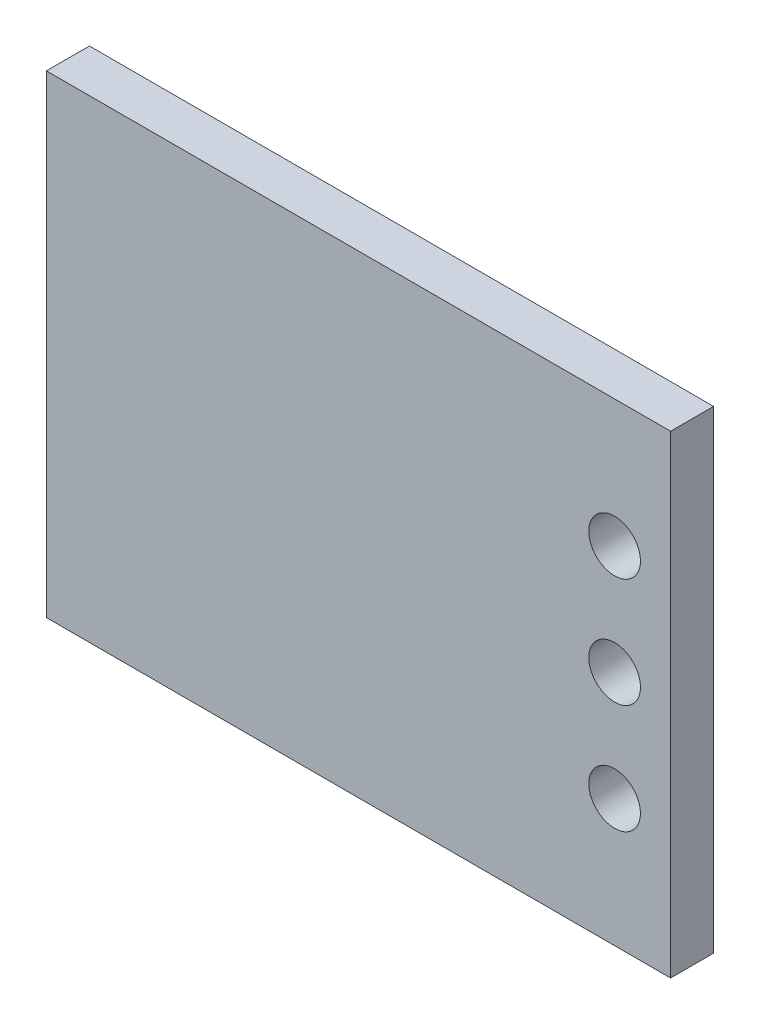
ISO-10303-21;
HEADER;
FILE_DESCRIPTION(('STEP AP214'),'2;1');
FILE_NAME('part.step','',(''),(''),'','','');
FILE_SCHEMA(('AUTOMOTIVE_DESIGN { 1 0 10303 214 1 1 1 1 }'));
ENDSEC;
DATA;
#1=APPLICATION_CONTEXT('core data for automotive mechanical design processes');
#2=APPLICATION_PROTOCOL_DEFINITION('international standard','automotive_design',2000,#1);
#3=PRODUCT_CONTEXT('',#1,'mechanical');
#4=PRODUCT('Part','Part','',(#3));
#5=PRODUCT_RELATED_PRODUCT_CATEGORY('part','',(#4));
#6=PRODUCT_DEFINITION_FORMATION('','',#4);
#7=PRODUCT_DEFINITION_CONTEXT('part definition',#1,'design');
#8=PRODUCT_DEFINITION('design','',#6,#7);
#9=PRODUCT_DEFINITION_SHAPE('','',#8);
#10=(LENGTH_UNIT() NAMED_UNIT(*) SI_UNIT(.MILLI.,.METRE.));
#11=(NAMED_UNIT(*) PLANE_ANGLE_UNIT() SI_UNIT($,.RADIAN.));
#12=(NAMED_UNIT(*) SI_UNIT($,.STERADIAN.) SOLID_ANGLE_UNIT());
#13=UNCERTAINTY_MEASURE_WITH_UNIT(LENGTH_MEASURE(1.E-05),#10,'distance_accuracy_value','');
#14=(GEOMETRIC_REPRESENTATION_CONTEXT(3) GLOBAL_UNCERTAINTY_ASSIGNED_CONTEXT((#13)) GLOBAL_UNIT_ASSIGNED_CONTEXT((#10,
#11,#12)) REPRESENTATION_CONTEXT('',''));
#15=CARTESIAN_POINT('',(0.,0.,0.));
#16=DIRECTION('',(0.,0.,1.));
#17=DIRECTION('',(1.,0.,0.));
#18=AXIS2_PLACEMENT_3D('',#15,#16,#17);
#19=CARTESIAN_POINT('',(0.,0.,1.));
#20=DIRECTION('',(0.,0.,1.));
#21=DIRECTION('',(1.,0.,0.));
#22=AXIS2_PLACEMENT_3D('',#19,#20,#21);
#23=PLANE('',#22);
#24=CARTESIAN_POINT('',(5.95,2.54,1.));
#25=DIRECTION('',(0.,0.,1.));
#26=DIRECTION('',(1.,0.,0.));
#27=AXIS2_PLACEMENT_3D('',#24,#25,#26);
#28=CIRCLE('',#27,0.6);
#29=CARTESIAN_POINT('',(6.55,2.54,1.));
#30=VERTEX_POINT('',#29);
#31=EDGE_CURVE('E119',#30,#30,#28,.T.);
#32=ORIENTED_EDGE('',*,*,#31,.F.);
#33=EDGE_LOOP('',(#32));
#34=FACE_BOUND('',#33,.T.);
#35=DIRECTION('',(0.,-1.,0.));
#36=VECTOR('',#35,1.);
#37=CARTESIAN_POINT('',(-7.25,-5.5,1.));
#38=LINE('',#37,#36);
#39=CARTESIAN_POINT('',(-7.25,5.5,1.));
#40=VERTEX_POINT('',#39);
#41=CARTESIAN_POINT('',(-7.25,-5.5,1.));
#42=VERTEX_POINT('',#41);
#43=EDGE_CURVE('E89',#40,#42,#38,.T.);
#44=ORIENTED_EDGE('',*,*,#43,.T.);
#45=DIRECTION('',(1.,0.,0.));
#46=VECTOR('',#45,1.);
#47=CARTESIAN_POINT('',(7.25,-5.5,1.));
#48=LINE('',#47,#46);
#49=CARTESIAN_POINT('',(7.25,-5.5,1.));
#50=VERTEX_POINT('',#49);
#51=EDGE_CURVE('E84',#42,#50,#48,.T.);
#52=ORIENTED_EDGE('',*,*,#51,.T.);
#53=DIRECTION('',(0.,1.,0.));
#54=VECTOR('',#53,1.);
#55=CARTESIAN_POINT('',(7.25,-5.5,1.));
#56=LINE('',#55,#54);
#57=CARTESIAN_POINT('',(7.25,5.5,1.));
#58=VERTEX_POINT('',#57);
#59=EDGE_CURVE('E87',#50,#58,#56,.T.);
#60=ORIENTED_EDGE('',*,*,#59,.T.);
#61=DIRECTION('',(-1.,0.,0.));
#62=VECTOR('',#61,1.);
#63=CARTESIAN_POINT('',(7.25,5.5,1.));
#64=LINE('',#63,#62);
#65=EDGE_CURVE('E54',#58,#40,#64,.T.);
#66=ORIENTED_EDGE('',*,*,#65,.T.);
#67=EDGE_LOOP('',(#44,#52,#60,#66));
#68=FACE_BOUND('',#67,.T.);
#69=CARTESIAN_POINT('',(5.95,0.,1.));
#70=DIRECTION('',(0.,0.,1.));
#71=DIRECTION('',(1.,0.,0.));
#72=AXIS2_PLACEMENT_3D('',#69,#70,#71);
#73=CIRCLE('',#72,0.6);
#74=CARTESIAN_POINT('',(6.55,0.,1.));
#75=VERTEX_POINT('',#74);
#76=EDGE_CURVE('E104',#75,#75,#73,.T.);
#77=ORIENTED_EDGE('',*,*,#76,.F.);
#78=EDGE_LOOP('',(#77));
#79=FACE_BOUND('',#78,.T.);
#80=CARTESIAN_POINT('',(5.95,-2.54,1.));
#81=DIRECTION('',(0.,0.,1.));
#82=DIRECTION('',(-1.,0.,0.));
#83=AXIS2_PLACEMENT_3D('',#80,#81,#82);
#84=CIRCLE('',#83,0.6);
#85=CARTESIAN_POINT('',(5.35,-2.54,1.));
#86=VERTEX_POINT('',#85);
#87=EDGE_CURVE('E125',#86,#86,#84,.T.);
#88=ORIENTED_EDGE('',*,*,#87,.F.);
#89=EDGE_LOOP('',(#88));
#90=FACE_BOUND('',#89,.T.);
#91=ADVANCED_FACE('F37',(#34,#68,#79,#90),#23,.T.);
#92=CARTESIAN_POINT('',(0.,0.,0.));
#93=DIRECTION('',(0.,0.,1.));
#94=DIRECTION('',(1.,0.,0.));
#95=AXIS2_PLACEMENT_3D('',#92,#93,#94);
#96=PLANE('',#95);
#97=DIRECTION('',(0.,-1.,0.));
#98=VECTOR('',#97,1.);
#99=CARTESIAN_POINT('',(-7.25,-5.5,0.));
#100=LINE('',#99,#98);
#101=CARTESIAN_POINT('',(-7.25,5.5,0.));
#102=VERTEX_POINT('',#101);
#103=CARTESIAN_POINT('',(-7.25,-5.5,0.));
#104=VERTEX_POINT('',#103);
#105=EDGE_CURVE('E101',#102,#104,#100,.T.);
#106=ORIENTED_EDGE('',*,*,#105,.F.);
#107=DIRECTION('',(-1.,0.,0.));
#108=VECTOR('',#107,1.);
#109=CARTESIAN_POINT('',(7.25,5.5,0.));
#110=LINE('',#109,#108);
#111=CARTESIAN_POINT('',(7.25,5.5,0.));
#112=VERTEX_POINT('',#111);
#113=EDGE_CURVE('E77',#112,#102,#110,.T.);
#114=ORIENTED_EDGE('',*,*,#113,.F.);
#115=DIRECTION('',(0.,1.,0.));
#116=VECTOR('',#115,1.);
#117=CARTESIAN_POINT('',(7.25,-5.5,0.));
#118=LINE('',#117,#116);
#119=CARTESIAN_POINT('',(7.25,-5.5,0.));
#120=VERTEX_POINT('',#119);
#121=EDGE_CURVE('E71',#120,#112,#118,.T.);
#122=ORIENTED_EDGE('',*,*,#121,.F.);
#123=DIRECTION('',(1.,0.,0.));
#124=VECTOR('',#123,1.);
#125=CARTESIAN_POINT('',(7.25,-5.5,0.));
#126=LINE('',#125,#124);
#127=EDGE_CURVE('E93',#104,#120,#126,.T.);
#128=ORIENTED_EDGE('',*,*,#127,.F.);
#129=EDGE_LOOP('',(#106,#114,#122,#128));
#130=FACE_BOUND('',#129,.T.);
#131=CARTESIAN_POINT('',(5.95,0.,0.));
#132=DIRECTION('',(0.,0.,1.));
#133=DIRECTION('',(1.,0.,0.));
#134=AXIS2_PLACEMENT_3D('',#131,#132,#133);
#135=CIRCLE('',#134,0.6);
#136=CARTESIAN_POINT('',(6.55,0.,0.));
#137=VERTEX_POINT('',#136);
#138=EDGE_CURVE('E116',#137,#137,#135,.T.);
#139=ORIENTED_EDGE('',*,*,#138,.T.);
#140=EDGE_LOOP('',(#139));
#141=FACE_BOUND('',#140,.T.);
#142=CARTESIAN_POINT('',(5.95,2.54,0.));
#143=DIRECTION('',(0.,0.,1.));
#144=DIRECTION('',(1.,0.,0.));
#145=AXIS2_PLACEMENT_3D('',#142,#143,#144);
#146=CIRCLE('',#145,0.6);
#147=CARTESIAN_POINT('',(6.55,2.54,0.));
#148=VERTEX_POINT('',#147);
#149=EDGE_CURVE('E122',#148,#148,#146,.T.);
#150=ORIENTED_EDGE('',*,*,#149,.T.);
#151=EDGE_LOOP('',(#150));
#152=FACE_BOUND('',#151,.T.);
#153=CARTESIAN_POINT('',(5.95,-2.54,0.));
#154=DIRECTION('',(0.,0.,1.));
#155=DIRECTION('',(-1.,0.,0.));
#156=AXIS2_PLACEMENT_3D('',#153,#154,#155);
#157=CIRCLE('',#156,0.6);
#158=CARTESIAN_POINT('',(5.35,-2.54,0.));
#159=VERTEX_POINT('',#158);
#160=EDGE_CURVE('E128',#159,#159,#157,.T.);
#161=ORIENTED_EDGE('',*,*,#160,.T.);
#162=EDGE_LOOP('',(#161));
#163=FACE_BOUND('',#162,.T.);
#164=ADVANCED_FACE('F112',(#130,#141,#152,#163),#96,.F.);
#165=CARTESIAN_POINT('',(-7.25,-5.5,1.));
#166=DIRECTION('',(1.,0.,0.));
#167=DIRECTION('',(0.,0.,-1.));
#168=AXIS2_PLACEMENT_3D('',#165,#166,#167);
#169=PLANE('',#168);
#170=ORIENTED_EDGE('',*,*,#105,.T.);
#171=DIRECTION('',(0.,0.,-1.));
#172=VECTOR('',#171,1.);
#173=CARTESIAN_POINT('',(-7.25,-5.5,1.));
#174=LINE('',#173,#172);
#175=EDGE_CURVE('E11',#42,#104,#174,.T.);
#176=ORIENTED_EDGE('',*,*,#175,.F.);
#177=ORIENTED_EDGE('',*,*,#43,.F.);
#178=DIRECTION('',(0.,0.,-1.));
#179=VECTOR('',#178,1.);
#180=CARTESIAN_POINT('',(-7.25,5.5,1.));
#181=LINE('',#180,#179);
#182=EDGE_CURVE('E97',#40,#102,#181,.T.);
#183=ORIENTED_EDGE('',*,*,#182,.T.);
#184=EDGE_LOOP('',(#170,#176,#177,#183));
#185=FACE_BOUND('',#184,.T.);
#186=ADVANCED_FACE('F39',(#185),#169,.F.);
#187=CARTESIAN_POINT('',(7.25,-5.5,1.));
#188=DIRECTION('',(0.,1.,0.));
#189=DIRECTION('',(0.,0.,1.));
#190=AXIS2_PLACEMENT_3D('',#187,#188,#189);
#191=PLANE('',#190);
#192=ORIENTED_EDGE('',*,*,#127,.T.);
#193=DIRECTION('',(0.,0.,-1.));
#194=VECTOR('',#193,1.);
#195=CARTESIAN_POINT('',(7.25,-5.5,1.));
#196=LINE('',#195,#194);
#197=EDGE_CURVE('E46',#50,#120,#196,.T.);
#198=ORIENTED_EDGE('',*,*,#197,.F.);
#199=ORIENTED_EDGE('',*,*,#51,.F.);
#200=ORIENTED_EDGE('',*,*,#175,.T.);
#201=EDGE_LOOP('',(#192,#198,#199,#200));
#202=FACE_BOUND('',#201,.T.);
#203=ADVANCED_FACE('F92',(#202),#191,.F.);
#204=CARTESIAN_POINT('',(7.25,-5.5,1.));
#205=DIRECTION('',(-1.,0.,0.));
#206=DIRECTION('',(0.,0.,1.));
#207=AXIS2_PLACEMENT_3D('',#204,#205,#206);
#208=PLANE('',#207);
#209=ORIENTED_EDGE('',*,*,#121,.T.);
#210=DIRECTION('',(0.,0.,-1.));
#211=VECTOR('',#210,1.);
#212=CARTESIAN_POINT('',(7.25,5.5,1.));
#213=LINE('',#212,#211);
#214=EDGE_CURVE('E94',#58,#112,#213,.T.);
#215=ORIENTED_EDGE('',*,*,#214,.F.);
#216=ORIENTED_EDGE('',*,*,#59,.F.);
#217=ORIENTED_EDGE('',*,*,#197,.T.);
#218=EDGE_LOOP('',(#209,#215,#216,#217));
#219=FACE_BOUND('',#218,.T.);
#220=ADVANCED_FACE('F95',(#219),#208,.F.);
#221=CARTESIAN_POINT('',(7.25,5.5,1.));
#222=DIRECTION('',(0.,-1.,0.));
#223=DIRECTION('',(0.,0.,-1.));
#224=AXIS2_PLACEMENT_3D('',#221,#222,#223);
#225=PLANE('',#224);
#226=ORIENTED_EDGE('',*,*,#113,.T.);
#227=ORIENTED_EDGE('',*,*,#182,.F.);
#228=ORIENTED_EDGE('',*,*,#65,.F.);
#229=ORIENTED_EDGE('',*,*,#214,.T.);
#230=EDGE_LOOP('',(#226,#227,#228,#229));
#231=FACE_BOUND('',#230,.T.);
#232=ADVANCED_FACE('F109',(#231),#225,.F.);
#233=CARTESIAN_POINT('',(5.95,0.,1.));
#234=DIRECTION('',(0.,0.,-1.));
#235=DIRECTION('',(-1.,0.,0.));
#236=AXIS2_PLACEMENT_3D('',#233,#234,#235);
#237=CYLINDRICAL_SURFACE('',#236,0.6);
#238=ORIENTED_EDGE('',*,*,#76,.T.);
#239=EDGE_LOOP('',(#238));
#240=FACE_BOUND('',#239,.T.);
#241=ORIENTED_EDGE('',*,*,#138,.F.);
#242=EDGE_LOOP('',(#241));
#243=FACE_BOUND('',#242,.T.);
#244=ADVANCED_FACE('F146',(#240,#243),#237,.F.);
#245=CARTESIAN_POINT('',(5.95,2.54,1.));
#246=DIRECTION('',(0.,0.,-1.));
#247=DIRECTION('',(-1.,0.,0.));
#248=AXIS2_PLACEMENT_3D('',#245,#246,#247);
#249=CYLINDRICAL_SURFACE('',#248,0.6);
#250=ORIENTED_EDGE('',*,*,#31,.T.);
#251=EDGE_LOOP('',(#250));
#252=FACE_BOUND('',#251,.T.);
#253=ORIENTED_EDGE('',*,*,#149,.F.);
#254=EDGE_LOOP('',(#253));
#255=FACE_BOUND('',#254,.T.);
#256=ADVANCED_FACE('F192',(#252,#255),#249,.F.);
#257=CARTESIAN_POINT('',(5.95,-2.54,1.));
#258=DIRECTION('',(0.,0.,-1.));
#259=DIRECTION('',(-1.,0.,0.));
#260=AXIS2_PLACEMENT_3D('',#257,#258,#259);
#261=CYLINDRICAL_SURFACE('',#260,0.6);
#262=ORIENTED_EDGE('',*,*,#87,.T.);
#263=EDGE_LOOP('',(#262));
#264=FACE_BOUND('',#263,.T.);
#265=ORIENTED_EDGE('',*,*,#160,.F.);
#266=EDGE_LOOP('',(#265));
#267=FACE_BOUND('',#266,.T.);
#268=ADVANCED_FACE('F134',(#264,#267),#261,.F.);
#269=CLOSED_SHELL('',(#91,#164,#186,#203,#220,#232,#244,#256,#268));
#270=MANIFOLD_SOLID_BREP('B2',#269);
#271=ADVANCED_BREP_SHAPE_REPRESENTATION('',(#18,#270),#14);
#272=SHAPE_DEFINITION_REPRESENTATION(#9,#271);
ENDSEC;
END-ISO-10303-21;
